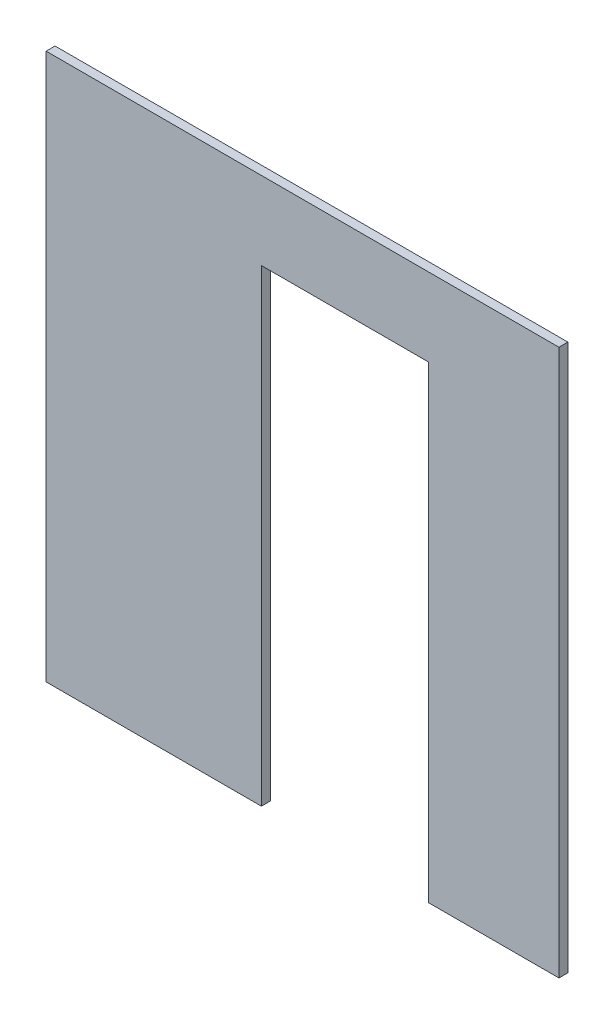
ISO-10303-21;
HEADER;
FILE_DESCRIPTION(('STEP AP214'),'2;1');
FILE_NAME('part.step','',(''),(''),'','','');
FILE_SCHEMA(('AUTOMOTIVE_DESIGN { 1 0 10303 214 1 1 1 1 }'));
ENDSEC;
DATA;
#1=APPLICATION_CONTEXT('core data for automotive mechanical design processes');
#2=APPLICATION_PROTOCOL_DEFINITION('international standard','automotive_design',2000,#1);
#3=PRODUCT_CONTEXT('',#1,'mechanical');
#4=PRODUCT('Part','Part','',(#3));
#5=PRODUCT_RELATED_PRODUCT_CATEGORY('part','',(#4));
#6=PRODUCT_DEFINITION_FORMATION('','',#4);
#7=PRODUCT_DEFINITION_CONTEXT('part definition',#1,'design');
#8=PRODUCT_DEFINITION('design','',#6,#7);
#9=PRODUCT_DEFINITION_SHAPE('','',#8);
#10=(LENGTH_UNIT() NAMED_UNIT(*) SI_UNIT(.MILLI.,.METRE.));
#11=(NAMED_UNIT(*) PLANE_ANGLE_UNIT() SI_UNIT($,.RADIAN.));
#12=(NAMED_UNIT(*) SI_UNIT($,.STERADIAN.) SOLID_ANGLE_UNIT());
#13=UNCERTAINTY_MEASURE_WITH_UNIT(LENGTH_MEASURE(1.E-05),#10,'distance_accuracy_value','');
#14=(GEOMETRIC_REPRESENTATION_CONTEXT(3) GLOBAL_UNCERTAINTY_ASSIGNED_CONTEXT((#13)) GLOBAL_UNIT_ASSIGNED_CONTEXT((#10,
#11,#12)) REPRESENTATION_CONTEXT('',''));
#15=CARTESIAN_POINT('',(0.,0.,0.));
#16=DIRECTION('',(0.,0.,1.));
#17=DIRECTION('',(1.,0.,0.));
#18=AXIS2_PLACEMENT_3D('',#15,#16,#17);
#19=CARTESIAN_POINT('',(0.,0.,40.));
#20=DIRECTION('',(0.,1.,0.));
#21=DIRECTION('',(0.,0.,1.));
#22=AXIS2_PLACEMENT_3D('',#19,#20,#21);
#23=PLANE('',#22);
#24=DIRECTION('',(0.,0.,-1.));
#25=VECTOR('',#24,1.);
#26=CARTESIAN_POINT('',(1715.4020495666,0.,100.));
#27=LINE('',#26,#25);
#28=CARTESIAN_POINT('',(1715.4020495666,0.,40.));
#29=VERTEX_POINT('',#28);
#30=CARTESIAN_POINT('',(1715.4020495666,0.,0.));
#31=VERTEX_POINT('',#30);
#32=EDGE_CURVE('E118',#29,#31,#27,.T.);
#33=ORIENTED_EDGE('',*,*,#32,.T.);
#34=DIRECTION('',(1.,0.,0.));
#35=VECTOR('',#34,1.);
#36=CARTESIAN_POINT('',(0.,0.,0.));
#37=LINE('',#36,#35);
#38=CARTESIAN_POINT('',(2300.,0.,0.));
#39=VERTEX_POINT('',#38);
#40=EDGE_CURVE('E137',#31,#39,#37,.T.);
#41=ORIENTED_EDGE('',*,*,#40,.T.);
#42=DIRECTION('',(0.,0.,-1.));
#43=VECTOR('',#42,1.);
#44=CARTESIAN_POINT('',(2300.,0.,40.));
#45=LINE('',#44,#43);
#46=CARTESIAN_POINT('',(2300.,0.,40.));
#47=VERTEX_POINT('',#46);
#48=EDGE_CURVE('E146',#47,#39,#45,.T.);
#49=ORIENTED_EDGE('',*,*,#48,.F.);
#50=DIRECTION('',(1.,0.,0.));
#51=VECTOR('',#50,1.);
#52=CARTESIAN_POINT('',(0.,0.,40.));
#53=LINE('',#52,#51);
#54=EDGE_CURVE('E126',#29,#47,#53,.T.);
#55=ORIENTED_EDGE('',*,*,#54,.F.);
#56=EDGE_LOOP('',(#33,#41,#49,#55));
#57=FACE_BOUND('',#56,.T.);
#58=ADVANCED_FACE('F33',(#57),#23,.F.);
#59=DIRECTION('',(0.,0.,-1.));
#60=VECTOR('',#59,1.);
#61=CARTESIAN_POINT('',(965.402049566603,0.,100.));
#62=LINE('',#61,#60);
#63=CARTESIAN_POINT('',(965.402049566603,0.,40.));
#64=VERTEX_POINT('',#63);
#65=CARTESIAN_POINT('',(965.402049566603,0.,0.));
#66=VERTEX_POINT('',#65);
#67=EDGE_CURVE('E48',#64,#66,#62,.T.);
#68=ORIENTED_EDGE('',*,*,#67,.F.);
#69=CARTESIAN_POINT('',(0.,0.,40.));
#70=VERTEX_POINT('',#69);
#71=EDGE_CURVE('E85',#70,#64,#53,.T.);
#72=ORIENTED_EDGE('',*,*,#71,.F.);
#73=DIRECTION('',(0.,0.,-1.));
#74=VECTOR('',#73,1.);
#75=CARTESIAN_POINT('',(0.,0.,40.));
#76=LINE('',#75,#74);
#77=CARTESIAN_POINT('',(0.,0.,0.));
#78=VERTEX_POINT('',#77);
#79=EDGE_CURVE('E149',#70,#78,#76,.T.);
#80=ORIENTED_EDGE('',*,*,#79,.T.);
#81=EDGE_CURVE('E117',#78,#66,#37,.T.);
#82=ORIENTED_EDGE('',*,*,#81,.T.);
#83=EDGE_LOOP('',(#68,#72,#80,#82));
#84=FACE_BOUND('',#83,.T.);
#85=ADVANCED_FACE('F116',(#84),#23,.F.);
#86=CARTESIAN_POINT('',(0.,0.,40.));
#87=DIRECTION('',(0.,0.,-1.));
#88=DIRECTION('',(-1.,0.,0.));
#89=AXIS2_PLACEMENT_3D('',#86,#87,#88);
#90=PLANE('',#89);
#91=DIRECTION('',(0.,1.,0.));
#92=VECTOR('',#91,1.);
#93=CARTESIAN_POINT('',(1715.4020495666,0.,40.));
#94=LINE('',#93,#92);
#95=CARTESIAN_POINT('',(1715.4020495666,2100.,40.));
#96=VERTEX_POINT('',#95);
#97=EDGE_CURVE('E138',#29,#96,#94,.T.);
#98=ORIENTED_EDGE('',*,*,#97,.F.);
#99=ORIENTED_EDGE('',*,*,#54,.T.);
#100=DIRECTION('',(0.,1.,0.));
#101=VECTOR('',#100,1.);
#102=CARTESIAN_POINT('',(2300.,0.,40.));
#103=LINE('',#102,#101);
#104=CARTESIAN_POINT('',(2300.,2450.,40.));
#105=VERTEX_POINT('',#104);
#106=EDGE_CURVE('E125',#47,#105,#103,.T.);
#107=ORIENTED_EDGE('',*,*,#106,.T.);
#108=DIRECTION('',(-1.,0.,0.));
#109=VECTOR('',#108,1.);
#110=CARTESIAN_POINT('',(0.,2450.,40.));
#111=LINE('',#110,#109);
#112=CARTESIAN_POINT('',(0.,2450.,40.));
#113=VERTEX_POINT('',#112);
#114=EDGE_CURVE('E57',#105,#113,#111,.T.);
#115=ORIENTED_EDGE('',*,*,#114,.T.);
#116=DIRECTION('',(0.,-1.,0.));
#117=VECTOR('',#116,1.);
#118=CARTESIAN_POINT('',(0.,0.,40.));
#119=LINE('',#118,#117);
#120=EDGE_CURVE('E123',#113,#70,#119,.T.);
#121=ORIENTED_EDGE('',*,*,#120,.T.);
#122=ORIENTED_EDGE('',*,*,#71,.T.);
#123=DIRECTION('',(0.,-1.,0.));
#124=VECTOR('',#123,1.);
#125=CARTESIAN_POINT('',(965.402049566603,0.,40.));
#126=LINE('',#125,#124);
#127=CARTESIAN_POINT('',(965.402049566603,2100.,40.));
#128=VERTEX_POINT('',#127);
#129=EDGE_CURVE('E107',#128,#64,#126,.T.);
#130=ORIENTED_EDGE('',*,*,#129,.F.);
#131=DIRECTION('',(-1.,0.,0.));
#132=VECTOR('',#131,1.);
#133=CARTESIAN_POINT('',(0.,2100.,40.));
#134=LINE('',#133,#132);
#135=EDGE_CURVE('E112',#96,#128,#134,.T.);
#136=ORIENTED_EDGE('',*,*,#135,.F.);
#137=EDGE_LOOP('',(#98,#99,#107,#115,#121,#122,#130,#136));
#138=FACE_BOUND('',#137,.T.);
#139=ADVANCED_FACE('F121',(#138),#90,.F.);
#140=CARTESIAN_POINT('',(0.,0.,0.));
#141=DIRECTION('',(0.,0.,-1.));
#142=DIRECTION('',(-1.,0.,0.));
#143=AXIS2_PLACEMENT_3D('',#140,#141,#142);
#144=PLANE('',#143);
#145=ORIENTED_EDGE('',*,*,#40,.F.);
#146=DIRECTION('',(0.,1.,0.));
#147=VECTOR('',#146,1.);
#148=CARTESIAN_POINT('',(1715.4020495666,0.,0.));
#149=LINE('',#148,#147);
#150=CARTESIAN_POINT('',(1715.4020495666,2100.,0.));
#151=VERTEX_POINT('',#150);
#152=EDGE_CURVE('E11',#31,#151,#149,.T.);
#153=ORIENTED_EDGE('',*,*,#152,.T.);
#154=DIRECTION('',(-1.,0.,0.));
#155=VECTOR('',#154,1.);
#156=CARTESIAN_POINT('',(0.,2100.,0.));
#157=LINE('',#156,#155);
#158=CARTESIAN_POINT('',(965.402049566603,2100.,0.));
#159=VERTEX_POINT('',#158);
#160=EDGE_CURVE('E41',#151,#159,#157,.T.);
#161=ORIENTED_EDGE('',*,*,#160,.T.);
#162=DIRECTION('',(0.,-1.,0.));
#163=VECTOR('',#162,1.);
#164=CARTESIAN_POINT('',(965.402049566603,0.,0.));
#165=LINE('',#164,#163);
#166=EDGE_CURVE('E151',#159,#66,#165,.T.);
#167=ORIENTED_EDGE('',*,*,#166,.T.);
#168=ORIENTED_EDGE('',*,*,#81,.F.);
#169=DIRECTION('',(0.,-1.,0.));
#170=VECTOR('',#169,1.);
#171=CARTESIAN_POINT('',(0.,0.,0.));
#172=LINE('',#171,#170);
#173=CARTESIAN_POINT('',(0.,2450.,0.));
#174=VERTEX_POINT('',#173);
#175=EDGE_CURVE('E134',#174,#78,#172,.T.);
#176=ORIENTED_EDGE('',*,*,#175,.F.);
#177=DIRECTION('',(-1.,0.,0.));
#178=VECTOR('',#177,1.);
#179=CARTESIAN_POINT('',(0.,2450.,0.));
#180=LINE('',#179,#178);
#181=CARTESIAN_POINT('',(2300.,2450.,0.));
#182=VERTEX_POINT('',#181);
#183=EDGE_CURVE('E78',#182,#174,#180,.T.);
#184=ORIENTED_EDGE('',*,*,#183,.F.);
#185=DIRECTION('',(0.,1.,0.));
#186=VECTOR('',#185,1.);
#187=CARTESIAN_POINT('',(2300.,0.,0.));
#188=LINE('',#187,#186);
#189=EDGE_CURVE('E140',#39,#182,#188,.T.);
#190=ORIENTED_EDGE('',*,*,#189,.F.);
#191=EDGE_LOOP('',(#145,#153,#161,#167,#168,#176,#184,#190));
#192=FACE_BOUND('',#191,.T.);
#193=ADVANCED_FACE('F155',(#192),#144,.T.);
#194=CARTESIAN_POINT('',(0.,0.,40.));
#195=DIRECTION('',(1.,0.,0.));
#196=DIRECTION('',(0.,0.,-1.));
#197=AXIS2_PLACEMENT_3D('',#194,#195,#196);
#198=PLANE('',#197);
#199=ORIENTED_EDGE('',*,*,#175,.T.);
#200=ORIENTED_EDGE('',*,*,#79,.F.);
#201=ORIENTED_EDGE('',*,*,#120,.F.);
#202=DIRECTION('',(0.,0.,-1.));
#203=VECTOR('',#202,1.);
#204=CARTESIAN_POINT('',(0.,2450.,40.));
#205=LINE('',#204,#203);
#206=EDGE_CURVE('E133',#113,#174,#205,.T.);
#207=ORIENTED_EDGE('',*,*,#206,.T.);
#208=EDGE_LOOP('',(#199,#200,#201,#207));
#209=FACE_BOUND('',#208,.T.);
#210=ADVANCED_FACE('F35',(#209),#198,.F.);
#211=CARTESIAN_POINT('',(2300.,0.,40.));
#212=DIRECTION('',(-1.,0.,0.));
#213=DIRECTION('',(0.,0.,1.));
#214=AXIS2_PLACEMENT_3D('',#211,#212,#213);
#215=PLANE('',#214);
#216=ORIENTED_EDGE('',*,*,#189,.T.);
#217=DIRECTION('',(0.,0.,-1.));
#218=VECTOR('',#217,1.);
#219=CARTESIAN_POINT('',(2300.,2450.,40.));
#220=LINE('',#219,#218);
#221=EDGE_CURVE('E144',#105,#182,#220,.T.);
#222=ORIENTED_EDGE('',*,*,#221,.F.);
#223=ORIENTED_EDGE('',*,*,#106,.F.);
#224=ORIENTED_EDGE('',*,*,#48,.T.);
#225=EDGE_LOOP('',(#216,#222,#223,#224));
#226=FACE_BOUND('',#225,.T.);
#227=ADVANCED_FACE('F173',(#226),#215,.F.);
#228=CARTESIAN_POINT('',(0.,2450.,40.));
#229=DIRECTION('',(0.,-1.,0.));
#230=DIRECTION('',(0.,0.,-1.));
#231=AXIS2_PLACEMENT_3D('',#228,#229,#230);
#232=PLANE('',#231);
#233=ORIENTED_EDGE('',*,*,#183,.T.);
#234=ORIENTED_EDGE('',*,*,#206,.F.);
#235=ORIENTED_EDGE('',*,*,#114,.F.);
#236=ORIENTED_EDGE('',*,*,#221,.T.);
#237=EDGE_LOOP('',(#233,#234,#235,#236));
#238=FACE_BOUND('',#237,.T.);
#239=ADVANCED_FACE('F174',(#238),#232,.F.);
#240=CARTESIAN_POINT('',(1715.4020495666,0.,100.));
#241=DIRECTION('',(-1.,0.,0.));
#242=DIRECTION('',(0.,0.,1.));
#243=AXIS2_PLACEMENT_3D('',#240,#241,#242);
#244=PLANE('',#243);
#245=ORIENTED_EDGE('',*,*,#97,.T.);
#246=DIRECTION('',(0.,0.,-1.));
#247=VECTOR('',#246,1.);
#248=CARTESIAN_POINT('',(1715.4020495666,2100.,100.));
#249=LINE('',#248,#247);
#250=EDGE_CURVE('E113',#96,#151,#249,.T.);
#251=ORIENTED_EDGE('',*,*,#250,.T.);
#252=ORIENTED_EDGE('',*,*,#152,.F.);
#253=ORIENTED_EDGE('',*,*,#32,.F.);
#254=EDGE_LOOP('',(#245,#251,#252,#253));
#255=FACE_BOUND('',#254,.T.);
#256=ADVANCED_FACE('F161',(#255),#244,.T.);
#257=CARTESIAN_POINT('',(1715.4020495666,2100.,100.));
#258=DIRECTION('',(0.,-1.,0.));
#259=DIRECTION('',(0.,0.,-1.));
#260=AXIS2_PLACEMENT_3D('',#257,#258,#259);
#261=PLANE('',#260);
#262=ORIENTED_EDGE('',*,*,#135,.T.);
#263=DIRECTION('',(0.,0.,-1.));
#264=VECTOR('',#263,1.);
#265=CARTESIAN_POINT('',(965.402049566603,2100.,100.));
#266=LINE('',#265,#264);
#267=EDGE_CURVE('E110',#128,#159,#266,.T.);
#268=ORIENTED_EDGE('',*,*,#267,.T.);
#269=ORIENTED_EDGE('',*,*,#160,.F.);
#270=ORIENTED_EDGE('',*,*,#250,.F.);
#271=EDGE_LOOP('',(#262,#268,#269,#270));
#272=FACE_BOUND('',#271,.T.);
#273=ADVANCED_FACE('F159',(#272),#261,.T.);
#274=CARTESIAN_POINT('',(965.402049566603,0.,100.));
#275=DIRECTION('',(1.,0.,0.));
#276=DIRECTION('',(0.,0.,-1.));
#277=AXIS2_PLACEMENT_3D('',#274,#275,#276);
#278=PLANE('',#277);
#279=ORIENTED_EDGE('',*,*,#129,.T.);
#280=ORIENTED_EDGE('',*,*,#67,.T.);
#281=ORIENTED_EDGE('',*,*,#166,.F.);
#282=ORIENTED_EDGE('',*,*,#267,.F.);
#283=EDGE_LOOP('',(#279,#280,#281,#282));
#284=FACE_BOUND('',#283,.T.);
#285=ADVANCED_FACE('F108',(#284),#278,.T.);
#286=CLOSED_SHELL('',(#58,#85,#139,#193,#210,#227,#239,#256,#273,#285));
#287=MANIFOLD_SOLID_BREP('B2',#286);
#288=ADVANCED_BREP_SHAPE_REPRESENTATION('',(#18,#287),#14);
#289=SHAPE_DEFINITION_REPRESENTATION(#9,#288);
ENDSEC;
END-ISO-10303-21;
